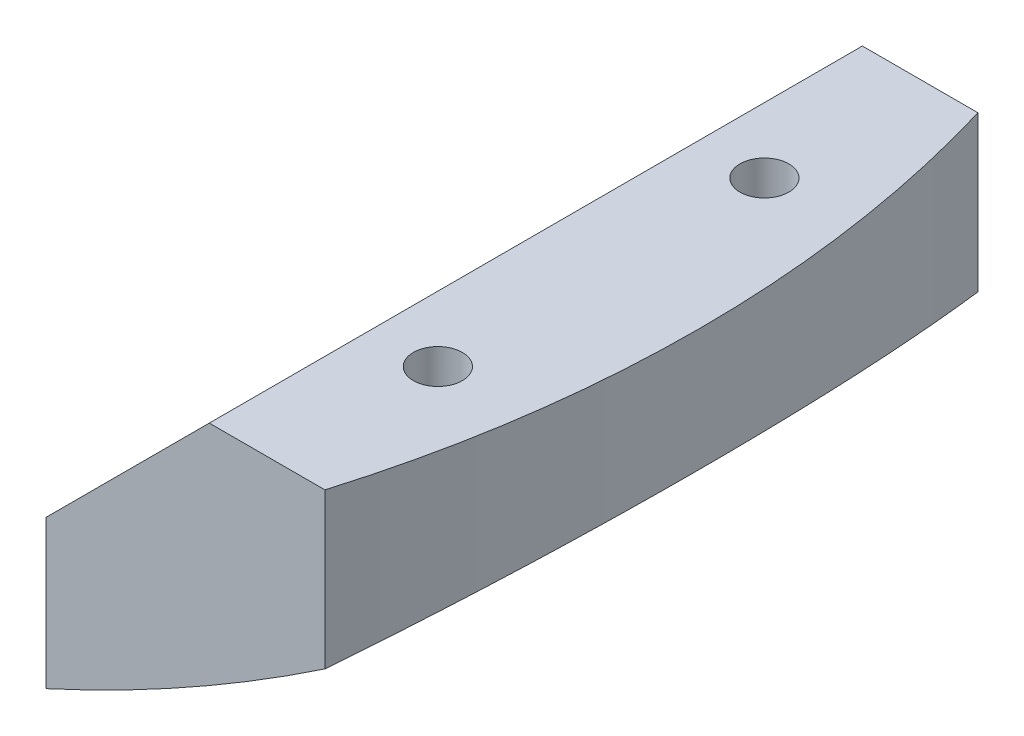
ISO-10303-21;
HEADER;
FILE_DESCRIPTION(('STEP AP214'),'2;1');
FILE_NAME('part.step','',(''),(''),'','','');
FILE_SCHEMA(('AUTOMOTIVE_DESIGN { 1 0 10303 214 1 1 1 1 }'));
ENDSEC;
DATA;
#1=APPLICATION_CONTEXT('core data for automotive mechanical design processes');
#2=APPLICATION_PROTOCOL_DEFINITION('international standard','automotive_design',2000,#1);
#3=PRODUCT_CONTEXT('',#1,'mechanical');
#4=PRODUCT('Part','Part','',(#3));
#5=PRODUCT_RELATED_PRODUCT_CATEGORY('part','',(#4));
#6=PRODUCT_DEFINITION_FORMATION('','',#4);
#7=PRODUCT_DEFINITION_CONTEXT('part definition',#1,'design');
#8=PRODUCT_DEFINITION('design','',#6,#7);
#9=PRODUCT_DEFINITION_SHAPE('','',#8);
#10=(LENGTH_UNIT() NAMED_UNIT(*) SI_UNIT(.MILLI.,.METRE.));
#11=(NAMED_UNIT(*) PLANE_ANGLE_UNIT() SI_UNIT($,.RADIAN.));
#12=(NAMED_UNIT(*) SI_UNIT($,.STERADIAN.) SOLID_ANGLE_UNIT());
#13=UNCERTAINTY_MEASURE_WITH_UNIT(LENGTH_MEASURE(1.E-05),#10,'distance_accuracy_value','');
#14=(GEOMETRIC_REPRESENTATION_CONTEXT(3) GLOBAL_UNCERTAINTY_ASSIGNED_CONTEXT((#13)) GLOBAL_UNIT_ASSIGNED_CONTEXT((#10,
#11,#12)) REPRESENTATION_CONTEXT('',''));
#15=CARTESIAN_POINT('',(0.,0.,0.));
#16=DIRECTION('',(0.,0.,1.));
#17=DIRECTION('',(1.,0.,0.));
#18=AXIS2_PLACEMENT_3D('',#15,#16,#17);
#19=CARTESIAN_POINT('',(0.,-10.,-9.99999999999989));
#20=DIRECTION('',(0.,0.,-1.));
#21=DIRECTION('',(-1.,0.,0.));
#22=AXIS2_PLACEMENT_3D('',#19,#20,#21);
#23=PLANE('',#22);
#24=DIRECTION('',(-0.707106781186548,-0.707106781186547,0.));
#25=VECTOR('',#24,1.);
#26=CARTESIAN_POINT('',(9.99999999999996,-20.,-9.99999999999993));
#27=LINE('',#26,#25);
#28=CARTESIAN_POINT('',(30.,0.,-10.));
#29=VERTEX_POINT('',#28);
#30=CARTESIAN_POINT('',(25.,-5.,-9.99999999999999));
#31=VERTEX_POINT('',#30);
#32=EDGE_CURVE('E122',#29,#31,#27,.T.);
#33=ORIENTED_EDGE('',*,*,#32,.F.);
#34=DIRECTION('',(-1.,0.,0.));
#35=VECTOR('',#34,1.);
#36=CARTESIAN_POINT('',(0.,0.,-9.99999999999989));
#37=LINE('',#36,#35);
#38=CARTESIAN_POINT('',(33.5410196624968,0.,-10.));
#39=VERTEX_POINT('',#38);
#40=EDGE_CURVE('E152',#39,#29,#37,.T.);
#41=ORIENTED_EDGE('',*,*,#40,.F.);
#42=DIRECTION('',(0.,1.,0.));
#43=VECTOR('',#42,1.);
#44=CARTESIAN_POINT('',(33.5410196624969,-10.,-10.));
#45=LINE('',#44,#43);
#46=CARTESIAN_POINT('',(33.5410196624969,-4.74937185533099,-10.));
#47=VERTEX_POINT('',#46);
#48=EDGE_CURVE('E77',#47,#39,#45,.T.);
#49=ORIENTED_EDGE('',*,*,#48,.F.);
#50=CARTESIAN_POINT('',(0.,45.,-10.));
#51=DIRECTION('',(0.,0.,1.));
#52=DIRECTION('',(1.,0.,0.));
#53=AXIS2_PLACEMENT_3D('',#50,#51,#52);
#54=CIRCLE('',#53,60.);
#55=CARTESIAN_POINT('',(25.,-9.54356057317857,-10.));
#56=VERTEX_POINT('',#55);
#57=EDGE_CURVE('E156',#56,#47,#54,.T.);
#58=ORIENTED_EDGE('',*,*,#57,.F.);
#59=DIRECTION('',(0.,1.,0.));
#60=VECTOR('',#59,1.);
#61=CARTESIAN_POINT('',(25.,-10.,-9.99999999999999));
#62=LINE('',#61,#60);
#63=EDGE_CURVE('E140',#56,#31,#62,.T.);
#64=ORIENTED_EDGE('',*,*,#63,.T.);
#65=EDGE_LOOP('',(#33,#41,#49,#58,#64));
#66=FACE_BOUND('',#65,.T.);
#67=ADVANCED_FACE('F70',(#66),#23,.T.);
#68=CARTESIAN_POINT('',(0.,-10.,0.));
#69=DIRECTION('',(0.,1.,0.));
#70=DIRECTION('',(0.,0.,1.));
#71=AXIS2_PLACEMENT_3D('',#68,#69,#70);
#72=CYLINDRICAL_SURFACE('',#71,35.);
#73=CARTESIAN_POINT('',(33.5410196624969,-4.74937185533099,-9.99999999999999));
#74=CARTESIAN_POINT('',(33.659201903285,-4.66968986743083,-9.60360278339722));
#75=CARTESIAN_POINT('',(33.7705651064402,-4.59400045766203,-9.20441068116045));
#76=CARTESIAN_POINT('',(33.9793775250653,-4.45116738743564,-8.40085198211607));
#77=CARTESIAN_POINT('',(34.0768254005166,-4.38402455006356,-7.99648489104728));
#78=CARTESIAN_POINT('',(34.3478932545481,-4.19624884524328,-6.77616427995109));
#79=CARTESIAN_POINT('',(34.5001804531202,-4.08930758102926,-5.95318213903755));
#80=CARTESIAN_POINT('',(34.7420784644686,-3.91839414848421,-4.31863233770059));
#81=CARTESIAN_POINT('',(34.8333958635781,-3.85325417553063,-3.50743737517138));
#82=CARTESIAN_POINT('',(34.9590870233687,-3.76339057546608,-1.87859387434422));
#83=CARTESIAN_POINT('',(34.993476848215,-3.73865554667092,-1.06094722208238));
#84=CARTESIAN_POINT('',(35.0051083768938,-3.73030399687934,0.614171198699587));
#85=CARTESIAN_POINT('',(34.9795313723348,-3.74871553799105,1.4716730376748));
#86=CARTESIAN_POINT('',(34.8656886626382,-3.83020246318116,3.18077128811616));
#87=CARTESIAN_POINT('',(34.777399198776,-3.89329477462027,4.03236533789918));
#88=CARTESIAN_POINT('',(34.5971619347456,-4.02082972105068,5.31323747078389));
#89=CARTESIAN_POINT('',(34.5276724320022,-4.06983531646028,5.74740143908146));
#90=CARTESIAN_POINT('',(34.3726623704704,-4.17854311351087,6.6115574207736));
#91=CARTESIAN_POINT('',(34.2871411450149,-4.23824575997617,7.04154925989093));
#92=CARTESIAN_POINT('',(34.1004338089002,-4.36773576195528,7.89630841682124));
#93=CARTESIAN_POINT('',(33.9992565339961,-4.43751742773489,8.32107853653245));
#94=CARTESIAN_POINT('',(33.7815593444467,-4.58652510200654,9.16494441990144));
#95=CARTESIAN_POINT('',(33.6650411455214,-4.6657500542732,9.58404081233365));
#96=CARTESIAN_POINT('',(33.5410196624969,-4.749371855331,10.));
#97=B_SPLINE_CURVE_WITH_KNOTS('',3,(#73,#74,#75,#76,#77,#78,#79,#80,#81,#82,#83,#84,#85,#86,#87,
#88,#89,#90,#91,#92,#93,#94,#95,#96),.UNSPECIFIED.,.F.,.F.,(4,2,2,2,2,2,2,2,2,2,2,4),(0.,
1.26356519198517,2.52725198085747,5.05523210574201,7.50909983613138,9.96227500125033,
12.5330550296944,15.1048095224638,16.4316811605332,17.7586079878136,19.0847886546709,
20.4108211280376),.UNSPECIFIED.);
#98=CARTESIAN_POINT('',(33.5410196624969,-4.74937185533099,10.));
#99=VERTEX_POINT('',#98);
#100=EDGE_CURVE('E149',#47,#99,#97,.T.);
#101=ORIENTED_EDGE('',*,*,#100,.F.);
#102=ORIENTED_EDGE('',*,*,#48,.T.);
#103=CARTESIAN_POINT('',(0.,0.,0.));
#104=DIRECTION('',(0.,-1.,0.));
#105=DIRECTION('',(0.,0.,-1.));
#106=AXIS2_PLACEMENT_3D('',#103,#104,#105);
#107=CIRCLE('',#106,35.);
#108=CARTESIAN_POINT('',(33.5410196624969,0.,10.));
#109=VERTEX_POINT('',#108);
#110=EDGE_CURVE('E91',#39,#109,#107,.T.);
#111=ORIENTED_EDGE('',*,*,#110,.T.);
#112=DIRECTION('',(0.,1.,0.));
#113=VECTOR('',#112,1.);
#114=CARTESIAN_POINT('',(33.5410196624969,-10.,10.));
#115=LINE('',#114,#113);
#116=EDGE_CURVE('E139',#99,#109,#115,.T.);
#117=ORIENTED_EDGE('',*,*,#116,.F.);
#118=EDGE_LOOP('',(#101,#102,#111,#117));
#119=FACE_BOUND('',#118,.T.);
#120=ADVANCED_FACE('F148',(#119),#72,.T.);
#121=CARTESIAN_POINT('',(0.,-10.,9.99999999999989));
#122=DIRECTION('',(0.,0.,-1.));
#123=DIRECTION('',(-1.,0.,0.));
#124=AXIS2_PLACEMENT_3D('',#121,#122,#123);
#125=PLANE('',#124);
#126=DIRECTION('',(-1.,0.,0.));
#127=VECTOR('',#126,1.);
#128=CARTESIAN_POINT('',(0.,0.,9.99999999999989));
#129=LINE('',#128,#127);
#130=CARTESIAN_POINT('',(30.,0.,10.));
#131=VERTEX_POINT('',#130);
#132=EDGE_CURVE('E136',#109,#131,#129,.T.);
#133=ORIENTED_EDGE('',*,*,#132,.T.);
#134=DIRECTION('',(-0.707106781186548,-0.707106781186547,0.));
#135=VECTOR('',#134,1.);
#136=CARTESIAN_POINT('',(9.99999999999996,-20.,9.99999999999993));
#137=LINE('',#136,#135);
#138=CARTESIAN_POINT('',(25.,-5.,9.99999999999999));
#139=VERTEX_POINT('',#138);
#140=EDGE_CURVE('E119',#131,#139,#137,.T.);
#141=ORIENTED_EDGE('',*,*,#140,.T.);
#142=DIRECTION('',(0.,1.,0.));
#143=VECTOR('',#142,1.);
#144=CARTESIAN_POINT('',(25.,-10.,9.99999999999999));
#145=LINE('',#144,#143);
#146=CARTESIAN_POINT('',(25.,-9.54356057317857,9.99999999999999));
#147=VERTEX_POINT('',#146);
#148=EDGE_CURVE('E134',#147,#139,#145,.T.);
#149=ORIENTED_EDGE('',*,*,#148,.F.);
#150=CARTESIAN_POINT('',(0.,45.,10.));
#151=DIRECTION('',(0.,0.,1.));
#152=DIRECTION('',(1.,0.,0.));
#153=AXIS2_PLACEMENT_3D('',#150,#151,#152);
#154=CIRCLE('',#153,60.);
#155=EDGE_CURVE('E83',#147,#99,#154,.T.);
#156=ORIENTED_EDGE('',*,*,#155,.T.);
#157=ORIENTED_EDGE('',*,*,#116,.T.);
#158=EDGE_LOOP('',(#133,#141,#149,#156,#157));
#159=FACE_BOUND('',#158,.T.);
#160=ADVANCED_FACE('F133',(#159),#125,.F.);
#161=CARTESIAN_POINT('',(25.,-10.,0.));
#162=DIRECTION('',(1.,0.,0.));
#163=DIRECTION('',(0.,0.,-1.));
#164=AXIS2_PLACEMENT_3D('',#161,#162,#163);
#165=PLANE('',#164);
#166=ORIENTED_EDGE('',*,*,#148,.T.);
#167=DIRECTION('',(0.,0.,-1.));
#168=VECTOR('',#167,1.);
#169=CARTESIAN_POINT('',(25.,-5.,40.));
#170=LINE('',#169,#168);
#171=EDGE_CURVE('E115',#139,#31,#170,.T.);
#172=ORIENTED_EDGE('',*,*,#171,.T.);
#173=ORIENTED_EDGE('',*,*,#63,.F.);
#174=DIRECTION('',(0.,0.,1.));
#175=VECTOR('',#174,1.);
#176=CARTESIAN_POINT('',(25.,-9.54356057317857,-10.));
#177=LINE('',#176,#175);
#178=EDGE_CURVE('E12',#147,#56,#177,.F.);
#179=ORIENTED_EDGE('',*,*,#178,.F.);
#180=EDGE_LOOP('',(#166,#172,#173,#179));
#181=FACE_BOUND('',#180,.T.);
#182=ADVANCED_FACE('F138',(#181),#165,.F.);
#183=CARTESIAN_POINT('',(0.,45.,-10.));
#184=DIRECTION('',(0.,0.,1.));
#185=DIRECTION('',(1.,0.,0.));
#186=AXIS2_PLACEMENT_3D('',#183,#184,#185);
#187=CYLINDRICAL_SURFACE('',#186,60.);
#188=CARTESIAN_POINT('',(31.25,-6.21950312136969,5.));
#189=CARTESIAN_POINT('',(31.2500001587782,-6.21950303197228,4.9623474463272));
#190=CARTESIAN_POINT('',(31.2528493793678,-6.21776498818592,4.9246919687588));
#191=CARTESIAN_POINT('',(31.2640875699615,-6.21090577587789,4.85053261366639));
#192=CARTESIAN_POINT('',(31.2724782691787,-6.20578355132571,4.8140290993381));
#193=CARTESIAN_POINT('',(31.2943250644143,-6.19243479561706,4.7433115238446));
#194=CARTESIAN_POINT('',(31.3077656876766,-6.18421774668798,4.70909084154482));
#195=CARTESIAN_POINT('',(31.3390952199567,-6.16504125610074,4.64359578985685));
#196=CARTESIAN_POINT('',(31.3569849614307,-6.15408130122626,4.6123219733563));
#197=CARTESIAN_POINT('',(31.397601406471,-6.12916215148037,4.55164651754058));
#198=CARTESIAN_POINT('',(31.4205392636836,-6.11507162913046,4.52244104343032));
#199=CARTESIAN_POINT('',(31.4697818688544,-6.08476940717778,4.46829545662264));
#200=CARTESIAN_POINT('',(31.4960878923869,-6.06855690389747,4.44335696829898));
#201=CARTESIAN_POINT('',(31.5551643971583,-6.03207778662948,4.39479005948596));
#202=CARTESIAN_POINT('',(31.5883252262727,-6.01156086798356,4.37182511835103));
#203=CARTESIAN_POINT('',(31.6570810318517,-5.96892053531441,4.33179982514247));
#204=CARTESIAN_POINT('',(31.6926774012188,-5.94679620154426,4.31474288627513));
#205=CARTESIAN_POINT('',(31.7708377062049,-5.89809708576089,4.28446562485038));
#206=CARTESIAN_POINT('',(31.8136555652697,-5.87134682271546,4.27218066197658));
#207=CARTESIAN_POINT('',(31.9003013397441,-5.81705809894282,4.25534545036623));
#208=CARTESIAN_POINT('',(31.9441297538772,-5.78951924734043,4.25079910730566));
#209=CARTESIAN_POINT('',(32.0365246369631,-5.73129582768634,4.24931830944126));
#210=CARTESIAN_POINT('',(32.0850945268498,-5.70059100208647,4.2532536212137));
#211=CARTESIAN_POINT('',(32.1809779384126,-5.63978560020263,4.27053316767748));
#212=CARTESIAN_POINT('',(32.2282905643188,-5.6096854582797,4.28388393351444));
#213=CARTESIAN_POINT('',(32.3209791110489,-5.5505428190654,4.32029964193864));
#214=CARTESIAN_POINT('',(32.3663110956471,-5.52152543998759,4.34351883773267));
#215=CARTESIAN_POINT('',(32.4524288703768,-5.46625079674729,4.39963395808785));
#216=CARTESIAN_POINT('',(32.4932222833407,-5.43998890891182,4.43251330888081));
#217=CARTESIAN_POINT('',(32.5580942733516,-5.39813062328597,4.49747021989062));
#218=CARTESIAN_POINT('',(32.5837185981622,-5.38156467854445,4.52738851050005));
#219=CARTESIAN_POINT('',(32.6304741645245,-5.35129521490748,4.59185276049171));
#220=CARTESIAN_POINT('',(32.6516080064247,-5.33759003947933,4.62639602264832));
#221=CARTESIAN_POINT('',(32.6884912414603,-5.31364656669023,4.69970927051701));
#222=CARTESIAN_POINT('',(32.7042020607238,-5.30343311059152,4.73850704993125));
#223=CARTESIAN_POINT('',(32.7290452297061,-5.28727296637799,4.81899751284454));
#224=CARTESIAN_POINT('',(32.7381827920411,-5.2813228973967,4.86068787368385));
#225=CARTESIAN_POINT('',(32.748553356495,-5.27456897177062,4.94020828415989));
#226=CARTESIAN_POINT('',(32.7506173556047,-5.27322411673646,4.97788582017634));
#227=CARTESIAN_POINT('',(32.7490632704805,-5.27423650706543,5.05306609185257));
#228=CARTESIAN_POINT('',(32.7454471858978,-5.27659244957735,5.0905688843688));
#229=CARTESIAN_POINT('',(32.7331168693373,-5.28462099637936,5.16212187873172));
#230=CARTESIAN_POINT('',(32.7247037388467,-5.29009770429995,5.19624721516978));
#231=CARTESIAN_POINT('',(32.7034375877877,-5.30392956642881,5.26246004587129));
#232=CARTESIAN_POINT('',(32.6905839761786,-5.31228510381697,5.2945472681826));
#233=CARTESIAN_POINT('',(32.6601572699737,-5.33204220459904,5.35775766518975));
#234=CARTESIAN_POINT('',(32.6423614671978,-5.34358732284366,5.38872799048407));
#235=CARTESIAN_POINT('',(32.6031228040583,-5.36900763036631,5.44719600810564));
#236=CARTESIAN_POINT('',(32.5816783814761,-5.38288381769873,5.47469220410077));
#237=CARTESIAN_POINT('',(32.532773904126,-5.4144778341074,5.52930814459114));
#238=CARTESIAN_POINT('',(32.5048933318503,-5.43246103211925,5.55589687076095));
#239=CARTESIAN_POINT('',(32.4461865717192,-5.47025062303091,5.604037187381));
#240=CARTESIAN_POINT('',(32.4153587518574,-5.49005802583912,5.62558596398712));
#241=CARTESIAN_POINT('',(32.34637715362,-5.53428358684356,5.66661904563572));
#242=CARTESIAN_POINT('',(32.3078420212627,-5.55893130324459,5.68521574910585));
#243=CARTESIAN_POINT('',(32.2288306748497,-5.60933386582872,5.71549207892138));
#244=CARTESIAN_POINT('',(32.188353401247,-5.6350893155301,5.72716788206169));
#245=CARTESIAN_POINT('',(32.1008529221354,-5.69061320326731,5.74469852786653));
#246=CARTESIAN_POINT('',(32.0536780671472,-5.7204577932191,5.74956643182931));
#247=CARTESIAN_POINT('',(31.9591632456708,-5.78006509738283,5.75037860141282));
#248=CARTESIAN_POINT('',(31.9118231871848,-5.80982774023588,5.74631665988943));
#249=CARTESIAN_POINT('',(31.8157947005938,-5.87001650731926,5.72874742827598));
#250=CARTESIAN_POINT('',(31.7671636297737,-5.90039701838367,5.71476131664336));
#251=CARTESIAN_POINT('',(31.6727358727697,-5.95920808158215,5.67674414250058));
#252=CARTESIAN_POINT('',(31.6269362001959,-5.98764069179366,5.65272387833166));
#253=CARTESIAN_POINT('',(31.549290852333,-6.03571177029809,5.60087894276175));
#254=CARTESIAN_POINT('',(31.5165453974891,-6.05593669316699,5.5749404937329));
#255=CARTESIAN_POINT('',(31.4550869213539,-6.09382357627369,5.51705763547878));
#256=CARTESIAN_POINT('',(31.4263726400954,-6.11148633738803,5.48511511019666));
#257=CARTESIAN_POINT('',(31.3740339922869,-6.14363053657506,5.41542686820783));
#258=CARTESIAN_POINT('',(31.3504494593332,-6.15808709369157,5.37763938184744));
#259=CARTESIAN_POINT('',(31.3100210519598,-6.18284037588132,5.29738711410019));
#260=CARTESIAN_POINT('',(31.2931677565538,-6.19314291507851,5.25492897669706));
#261=CARTESIAN_POINT('',(31.2703331472049,-6.20709325317544,5.17702025390319));
#262=CARTESIAN_POINT('',(31.2627411448278,-6.21172766477474,5.14221071123283));
#263=CARTESIAN_POINT('',(31.2525755904095,-6.21793197291281,5.0716013676066));
#264=CARTESIAN_POINT('',(31.2499998490254,-6.21950320637339,5.03580200557882));
#265=CARTESIAN_POINT('',(31.25,-6.21950312136969,5.));
#266=B_SPLINE_CURVE_WITH_KNOTS('',3,(#188,#189,#190,#191,#192,#193,#194,#195,#196,#197,#198,
#199,#200,#201,#202,#203,#204,#205,#206,#207,#208,#209,#210,#211,#212,#213,#214,#215,#216,#217,
#218,#219,#220,#221,#222,#223,#224,#225,#226,#227,#228,#229,#230,#231,#232,#233,#234,#235,#236,
#237,#238,#239,#240,#241,#242,#243,#244,#245,#246,#247,#248,#249,#250,#251,#252,#253,#254,#255,
#256,#257,#258,#259,#260,#261,#262,#263,#264,#265),.UNSPECIFIED.,.T.,.F.,(4,2,2,2,2,2,2,2,2,2,2,
2,2,2,2,2,2,2,2,2,2,2,2,2,2,2,2,2,2,2,2,2,2,2,2,2,2,2,4),(0.,0.112818865951045,
0.225672953563612,0.338184044014872,0.450716201814009,0.569407758976003,0.688144400081505,
0.823378855951052,0.958691310470224,1.1139373776196,1.26926177414377,1.44126455293372,
1.61338676107189,1.78830453201232,1.96292393463516,2.09061449349092,2.21823090655967,
2.3467372006841,2.4751414761812,2.58782055835089,2.70045998118224,2.80670434005075,
2.91296284579426,3.02513061850359,3.13734653916429,3.26440774472997,3.39153972114003,
3.53909268112219,3.68672707570603,3.85409958214313,4.0215884661519,4.19776165685819,
4.37374574367513,4.51241967830858,4.65105017262043,4.79072150194064,4.93019665755025,
5.03751755134028,5.14479159451077),.UNSPECIFIED.);
#267=CARTESIAN_POINT('',(31.25,-6.21950312136969,5.));
#268=VERTEX_POINT('',#267);
#269=EDGE_CURVE('E284',#268,#268,#266,.T.);
#270=ORIENTED_EDGE('',*,*,#269,.F.);
#271=EDGE_LOOP('',(#270));
#272=FACE_BOUND('',#271,.T.);
#273=CARTESIAN_POINT('',(31.25,-6.21950312136969,-5.));
#274=CARTESIAN_POINT('',(31.2500001587782,-6.21950303197228,-5.0376525536728));
#275=CARTESIAN_POINT('',(31.2528493793678,-6.21776498818592,-5.0753080312412));
#276=CARTESIAN_POINT('',(31.2640875699615,-6.21090577587789,-5.14946738633361));
#277=CARTESIAN_POINT('',(31.2724782691787,-6.20578355132571,-5.1859709006619));
#278=CARTESIAN_POINT('',(31.2943250644143,-6.19243479561706,-5.2566884761554));
#279=CARTESIAN_POINT('',(31.3077656876766,-6.18421774668798,-5.29090915845518));
#280=CARTESIAN_POINT('',(31.3390952199567,-6.16504125610074,-5.35640421014315));
#281=CARTESIAN_POINT('',(31.3569849614307,-6.15408130122626,-5.3876780266437));
#282=CARTESIAN_POINT('',(31.397601406471,-6.12916215148037,-5.44835348245942));
#283=CARTESIAN_POINT('',(31.4205392636836,-6.11507162913046,-5.47755895656968));
#284=CARTESIAN_POINT('',(31.4697818688544,-6.08476940717778,-5.53170454337736));
#285=CARTESIAN_POINT('',(31.4960878923869,-6.06855690389747,-5.55664303170102));
#286=CARTESIAN_POINT('',(31.5551643971583,-6.03207778662948,-5.60520994051404));
#287=CARTESIAN_POINT('',(31.5883252262727,-6.01156086798356,-5.62817488164897));
#288=CARTESIAN_POINT('',(31.6570810318517,-5.96892053531441,-5.66820017485753));
#289=CARTESIAN_POINT('',(31.6926774012188,-5.94679620154426,-5.68525711372487));
#290=CARTESIAN_POINT('',(31.7708377062049,-5.89809708576089,-5.71553437514962));
#291=CARTESIAN_POINT('',(31.8136555652697,-5.87134682271546,-5.72781933802342));
#292=CARTESIAN_POINT('',(31.9003013397441,-5.81705809894282,-5.74465454963377));
#293=CARTESIAN_POINT('',(31.9441297538772,-5.78951924734043,-5.74920089269434));
#294=CARTESIAN_POINT('',(32.0365246369631,-5.73129582768634,-5.75068169055874));
#295=CARTESIAN_POINT('',(32.0850945268498,-5.70059100208647,-5.7467463787863));
#296=CARTESIAN_POINT('',(32.1809779384126,-5.63978560020263,-5.72946683232252));
#297=CARTESIAN_POINT('',(32.2282905643188,-5.6096854582797,-5.71611606648556));
#298=CARTESIAN_POINT('',(32.3209791110489,-5.5505428190654,-5.67970035806136));
#299=CARTESIAN_POINT('',(32.3663110956471,-5.52152543998759,-5.65648116226733));
#300=CARTESIAN_POINT('',(32.4524288703768,-5.46625079674729,-5.60036604191215));
#301=CARTESIAN_POINT('',(32.4932222833407,-5.43998890891182,-5.56748669111919));
#302=CARTESIAN_POINT('',(32.5580942733516,-5.39813062328597,-5.50252978010938));
#303=CARTESIAN_POINT('',(32.5837185981622,-5.38156467854445,-5.47261148949995));
#304=CARTESIAN_POINT('',(32.6304741645245,-5.35129521490748,-5.40814723950829));
#305=CARTESIAN_POINT('',(32.6516080064247,-5.33759003947933,-5.37360397735168));
#306=CARTESIAN_POINT('',(32.6884912414603,-5.31364656669023,-5.30029072948299));
#307=CARTESIAN_POINT('',(32.7042020607238,-5.30343311059152,-5.26149295006875));
#308=CARTESIAN_POINT('',(32.7290452297061,-5.28727296637799,-5.18100248715546));
#309=CARTESIAN_POINT('',(32.7381827920411,-5.2813228973967,-5.13931212631615));
#310=CARTESIAN_POINT('',(32.748553356495,-5.27456897177062,-5.05979171584011));
#311=CARTESIAN_POINT('',(32.7506173556047,-5.27322411673646,-5.02211417982366));
#312=CARTESIAN_POINT('',(32.7490632704805,-5.27423650706543,-4.94693390814743));
#313=CARTESIAN_POINT('',(32.7454471858978,-5.27659244957735,-4.9094311156312));
#314=CARTESIAN_POINT('',(32.7331168693373,-5.28462099637936,-4.83787812126828));
#315=CARTESIAN_POINT('',(32.7247037388467,-5.29009770429995,-4.80375278483022));
#316=CARTESIAN_POINT('',(32.7034375877877,-5.30392956642881,-4.73753995412871));
#317=CARTESIAN_POINT('',(32.6905839761786,-5.31228510381697,-4.7054527318174));
#318=CARTESIAN_POINT('',(32.6601572699737,-5.33204220459904,-4.64224233481025));
#319=CARTESIAN_POINT('',(32.6423614671978,-5.34358732284366,-4.61127200951593));
#320=CARTESIAN_POINT('',(32.6031228040583,-5.36900763036631,-4.55280399189436));
#321=CARTESIAN_POINT('',(32.5816783814761,-5.38288381769873,-4.52530779589923));
#322=CARTESIAN_POINT('',(32.532773904126,-5.4144778341074,-4.47069185540886));
#323=CARTESIAN_POINT('',(32.5048933318503,-5.43246103211925,-4.44410312923905));
#324=CARTESIAN_POINT('',(32.4461865717192,-5.47025062303091,-4.395962812619));
#325=CARTESIAN_POINT('',(32.4153587518574,-5.49005802583912,-4.37441403601288));
#326=CARTESIAN_POINT('',(32.34637715362,-5.53428358684356,-4.33338095436428));
#327=CARTESIAN_POINT('',(32.3078420212627,-5.55893130324459,-4.31478425089415));
#328=CARTESIAN_POINT('',(32.2288306748497,-5.60933386582872,-4.28450792107862));
#329=CARTESIAN_POINT('',(32.188353401247,-5.6350893155301,-4.27283211793831));
#330=CARTESIAN_POINT('',(32.1008529221354,-5.69061320326731,-4.25530147213347));
#331=CARTESIAN_POINT('',(32.0536780671472,-5.7204577932191,-4.25043356817069));
#332=CARTESIAN_POINT('',(31.9591632456708,-5.78006509738283,-4.24962139858718));
#333=CARTESIAN_POINT('',(31.9118231871848,-5.80982774023588,-4.25368334011057));
#334=CARTESIAN_POINT('',(31.8157947005938,-5.87001650731926,-4.27125257172402));
#335=CARTESIAN_POINT('',(31.7671636297737,-5.90039701838367,-4.28523868335664));
#336=CARTESIAN_POINT('',(31.6727358727697,-5.95920808158215,-4.32325585749942));
#337=CARTESIAN_POINT('',(31.6269362001959,-5.98764069179366,-4.34727612166834));
#338=CARTESIAN_POINT('',(31.549290852333,-6.03571177029809,-4.39912105723825));
#339=CARTESIAN_POINT('',(31.5165453974891,-6.05593669316699,-4.4250595062671));
#340=CARTESIAN_POINT('',(31.4550869213539,-6.09382357627369,-4.48294236452122));
#341=CARTESIAN_POINT('',(31.4263726400954,-6.11148633738803,-4.51488488980334));
#342=CARTESIAN_POINT('',(31.3740339922869,-6.14363053657506,-4.58457313179217));
#343=CARTESIAN_POINT('',(31.3504494593332,-6.15808709369157,-4.62236061815256));
#344=CARTESIAN_POINT('',(31.3100210519598,-6.18284037588132,-4.70261288589981));
#345=CARTESIAN_POINT('',(31.2931677565538,-6.19314291507851,-4.74507102330294));
#346=CARTESIAN_POINT('',(31.2703331472049,-6.20709325317544,-4.82297974609681));
#347=CARTESIAN_POINT('',(31.2627411448278,-6.21172766477474,-4.85778928876717));
#348=CARTESIAN_POINT('',(31.2525755904095,-6.21793197291281,-4.9283986323934));
#349=CARTESIAN_POINT('',(31.2499998490254,-6.21950320637339,-4.96419799442118));
#350=CARTESIAN_POINT('',(31.25,-6.21950312136969,-5.));
#351=B_SPLINE_CURVE_WITH_KNOTS('',3,(#273,#274,#275,#276,#277,#278,#279,#280,#281,#282,#283,
#284,#285,#286,#287,#288,#289,#290,#291,#292,#293,#294,#295,#296,#297,#298,#299,#300,#301,#302,
#303,#304,#305,#306,#307,#308,#309,#310,#311,#312,#313,#314,#315,#316,#317,#318,#319,#320,#321,
#322,#323,#324,#325,#326,#327,#328,#329,#330,#331,#332,#333,#334,#335,#336,#337,#338,#339,#340,
#341,#342,#343,#344,#345,#346,#347,#348,#349,#350),.UNSPECIFIED.,.T.,.F.,(4,2,2,2,2,2,2,2,2,2,2,
2,2,2,2,2,2,2,2,2,2,2,2,2,2,2,2,2,2,2,2,2,2,2,2,2,2,2,4),(0.,0.112818865951045,
0.225672953563612,0.338184044014872,0.450716201814009,0.569407758976003,0.688144400081505,
0.823378855951052,0.958691310470224,1.1139373776196,1.26926177414377,1.44126455293372,
1.61338676107189,1.78830453201232,1.96292393463516,2.09061449349092,2.21823090655967,
2.3467372006841,2.4751414761812,2.58782055835089,2.70045998118224,2.80670434005075,
2.91296284579427,3.02513061850359,3.13734653916429,3.26440774472997,3.39153972114003,
3.53909268112219,3.68672707570603,3.85409958214313,4.0215884661519,4.19776165685819,
4.37374574367513,4.51241967830858,4.65105017262043,4.79072150194064,4.93019665755025,
5.03751755134028,5.14479159451077),.UNSPECIFIED.);
#352=CARTESIAN_POINT('',(31.25,-6.21950312136969,-5.));
#353=VERTEX_POINT('',#352);
#354=EDGE_CURVE('E128',#353,#353,#351,.T.);
#355=ORIENTED_EDGE('',*,*,#354,.F.);
#356=EDGE_LOOP('',(#355));
#357=FACE_BOUND('',#356,.T.);
#358=ORIENTED_EDGE('',*,*,#100,.T.);
#359=ORIENTED_EDGE('',*,*,#155,.F.);
#360=ORIENTED_EDGE('',*,*,#178,.T.);
#361=ORIENTED_EDGE('',*,*,#57,.T.);
#362=EDGE_LOOP('',(#358,#359,#360,#361));
#363=FACE_BOUND('',#362,.T.);
#364=ADVANCED_FACE('F166',(#272,#357,#363),#187,.T.);
#365=CARTESIAN_POINT('',(30.,0.,40.));
#366=DIRECTION('',(0.707106781186547,-0.707106781186548,0.));
#367=DIRECTION('',(0.707106781186548,0.707106781186547,0.));
#368=AXIS2_PLACEMENT_3D('',#365,#366,#367);
#369=PLANE('',#368);
#370=ORIENTED_EDGE('',*,*,#32,.T.);
#371=ORIENTED_EDGE('',*,*,#171,.F.);
#372=ORIENTED_EDGE('',*,*,#140,.F.);
#373=DIRECTION('',(0.,0.,-1.));
#374=VECTOR('',#373,1.);
#375=CARTESIAN_POINT('',(30.,0.,40.));
#376=LINE('',#375,#374);
#377=EDGE_CURVE('E127',#131,#29,#376,.T.);
#378=ORIENTED_EDGE('',*,*,#377,.T.);
#379=EDGE_LOOP('',(#370,#371,#372,#378));
#380=FACE_BOUND('',#379,.T.);
#381=ADVANCED_FACE('F117',(#380),#369,.F.);
#382=CARTESIAN_POINT('',(35.,0.,40.));
#383=DIRECTION('',(0.,-1.,0.));
#384=DIRECTION('',(1.,0.,0.));
#385=AXIS2_PLACEMENT_3D('',#382,#383,#384);
#386=PLANE('',#385);
#387=CARTESIAN_POINT('',(32.,0.,5.));
#388=DIRECTION('',(0.,1.,0.));
#389=DIRECTION('',(-1.,0.,0.));
#390=AXIS2_PLACEMENT_3D('',#387,#388,#389);
#391=CIRCLE('',#390,0.749999999999999);
#392=CARTESIAN_POINT('',(31.25,0.,5.));
#393=VERTEX_POINT('',#392);
#394=EDGE_CURVE('E286',#393,#393,#391,.T.);
#395=ORIENTED_EDGE('',*,*,#394,.F.);
#396=EDGE_LOOP('',(#395));
#397=FACE_BOUND('',#396,.T.);
#398=CARTESIAN_POINT('',(32.,0.,-5.));
#399=DIRECTION('',(0.,1.,0.));
#400=DIRECTION('',(-1.,0.,0.));
#401=AXIS2_PLACEMENT_3D('',#398,#399,#400);
#402=CIRCLE('',#401,0.749999999999999);
#403=CARTESIAN_POINT('',(31.25,0.,-5.));
#404=VERTEX_POINT('',#403);
#405=EDGE_CURVE('E183',#404,#404,#402,.T.);
#406=ORIENTED_EDGE('',*,*,#405,.F.);
#407=EDGE_LOOP('',(#406));
#408=FACE_BOUND('',#407,.T.);
#409=ORIENTED_EDGE('',*,*,#40,.T.);
#410=ORIENTED_EDGE('',*,*,#377,.F.);
#411=ORIENTED_EDGE('',*,*,#132,.F.);
#412=ORIENTED_EDGE('',*,*,#110,.F.);
#413=EDGE_LOOP('',(#409,#410,#411,#412));
#414=FACE_BOUND('',#413,.T.);
#415=ADVANCED_FACE('F189',(#397,#408,#414),#386,.F.);
#416=CARTESIAN_POINT('',(32.,-9.54356057317857,-5.));
#417=DIRECTION('',(0.,1.,0.));
#418=DIRECTION('',(-1.,0.,0.));
#419=AXIS2_PLACEMENT_3D('',#416,#417,#418);
#420=CYLINDRICAL_SURFACE('',#419,0.749999999999999);
#421=ORIENTED_EDGE('',*,*,#354,.T.);
#422=EDGE_LOOP('',(#421));
#423=FACE_BOUND('',#422,.T.);
#424=ORIENTED_EDGE('',*,*,#405,.T.);
#425=EDGE_LOOP('',(#424));
#426=FACE_BOUND('',#425,.T.);
#427=ADVANCED_FACE('F184',(#423,#426),#420,.F.);
#428=CARTESIAN_POINT('',(32.,-9.54356057317857,5.));
#429=DIRECTION('',(0.,1.,0.));
#430=DIRECTION('',(-1.,0.,0.));
#431=AXIS2_PLACEMENT_3D('',#428,#429,#430);
#432=CYLINDRICAL_SURFACE('',#431,0.749999999999999);
#433=ORIENTED_EDGE('',*,*,#269,.T.);
#434=EDGE_LOOP('',(#433));
#435=FACE_BOUND('',#434,.T.);
#436=ORIENTED_EDGE('',*,*,#394,.T.);
#437=EDGE_LOOP('',(#436));
#438=FACE_BOUND('',#437,.T.);
#439=ADVANCED_FACE('F188',(#435,#438),#432,.F.);
#440=CLOSED_SHELL('',(#67,#120,#160,#182,#364,#381,#415,#427,#439));
#441=MANIFOLD_SOLID_BREP('B2',#440);
#442=ADVANCED_BREP_SHAPE_REPRESENTATION('',(#18,#441),#14);
#443=SHAPE_DEFINITION_REPRESENTATION(#9,#442);
ENDSEC;
END-ISO-10303-21;
